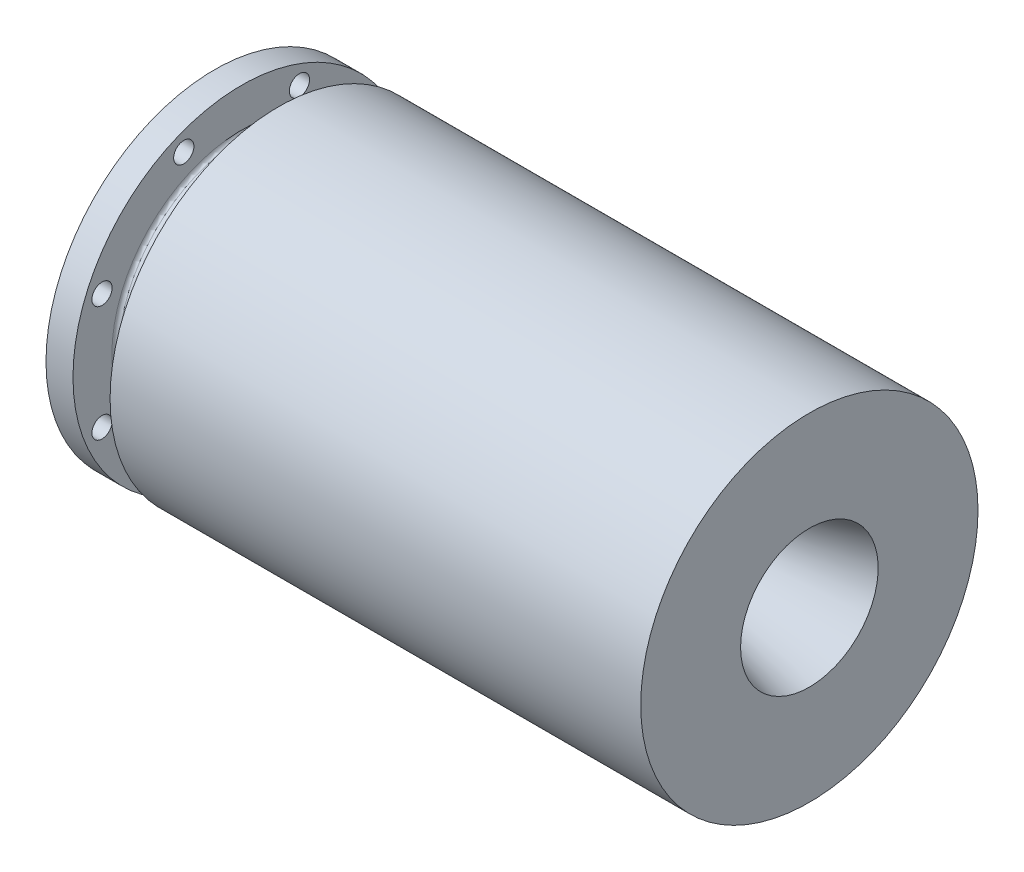
ISO-10303-21;
HEADER;
FILE_DESCRIPTION(('STEP AP214'),'2;1');
FILE_NAME('part.step','',(''),(''),'','','');
FILE_SCHEMA(('AUTOMOTIVE_DESIGN { 1 0 10303 214 1 1 1 1 }'));
ENDSEC;
DATA;
#1=APPLICATION_CONTEXT('core data for automotive mechanical design processes');
#2=APPLICATION_PROTOCOL_DEFINITION('international standard','automotive_design',2000,#1);
#3=PRODUCT_CONTEXT('',#1,'mechanical');
#4=PRODUCT('Part','Part','',(#3));
#5=PRODUCT_RELATED_PRODUCT_CATEGORY('part','',(#4));
#6=PRODUCT_DEFINITION_FORMATION('','',#4);
#7=PRODUCT_DEFINITION_CONTEXT('part definition',#1,'design');
#8=PRODUCT_DEFINITION('design','',#6,#7);
#9=PRODUCT_DEFINITION_SHAPE('','',#8);
#10=(LENGTH_UNIT() NAMED_UNIT(*) SI_UNIT(.MILLI.,.METRE.));
#11=(NAMED_UNIT(*) PLANE_ANGLE_UNIT() SI_UNIT($,.RADIAN.));
#12=(NAMED_UNIT(*) SI_UNIT($,.STERADIAN.) SOLID_ANGLE_UNIT());
#13=UNCERTAINTY_MEASURE_WITH_UNIT(LENGTH_MEASURE(1.E-05),#10,'distance_accuracy_value','');
#14=(GEOMETRIC_REPRESENTATION_CONTEXT(3) GLOBAL_UNCERTAINTY_ASSIGNED_CONTEXT((#13)) GLOBAL_UNIT_ASSIGNED_CONTEXT((#10,
#11,#12)) REPRESENTATION_CONTEXT('',''));
#15=CARTESIAN_POINT('',(0.,0.,0.));
#16=DIRECTION('',(0.,0.,1.));
#17=DIRECTION('',(1.,0.,0.));
#18=AXIS2_PLACEMENT_3D('',#15,#16,#17);
#19=CARTESIAN_POINT('',(0.,0.,0.));
#20=DIRECTION('',(-1.,0.,0.));
#21=DIRECTION('',(0.,0.,1.));
#22=AXIS2_PLACEMENT_3D('',#19,#20,#21);
#23=CYLINDRICAL_SURFACE('',#22,47.5996);
#24=CARTESIAN_POINT('',(22.86,0.,0.));
#25=DIRECTION('',(1.,0.,0.));
#26=DIRECTION('',(0.,0.,-1.));
#27=AXIS2_PLACEMENT_3D('',#24,#25,#26);
#28=CIRCLE('',#27,47.5996);
#29=CARTESIAN_POINT('',(22.86,0.,-47.5996));
#30=VERTEX_POINT('',#29);
#31=EDGE_CURVE('E62',#30,#30,#28,.F.);
#32=ORIENTED_EDGE('',*,*,#31,.T.);
#33=EDGE_LOOP('',(#32));
#34=FACE_BOUND('',#33,.T.);
#35=CARTESIAN_POINT('',(11.43,0.,0.));
#36=DIRECTION('',(-1.,0.,0.));
#37=DIRECTION('',(0.,0.,1.));
#38=AXIS2_PLACEMENT_3D('',#35,#36,#37);
#39=CIRCLE('',#38,47.5996);
#40=CARTESIAN_POINT('',(11.43,0.,47.5996));
#41=VERTEX_POINT('',#40);
#42=EDGE_CURVE('E65',#41,#41,#39,.F.);
#43=ORIENTED_EDGE('',*,*,#42,.T.);
#44=EDGE_LOOP('',(#43));
#45=FACE_BOUND('',#44,.T.);
#46=ADVANCED_FACE('F36',(#34,#45),#23,.T.);
#47=CARTESIAN_POINT('',(10.16,63.5,0.));
#48=DIRECTION('',(-1.,0.,0.));
#49=DIRECTION('',(0.,0.,1.));
#50=AXIS2_PLACEMENT_3D('',#47,#48,#49);
#51=PLANE('',#50);
#52=CARTESIAN_POINT('',(10.16,52.5650498817621,21.7731565678442));
#53=DIRECTION('',(-1.,0.,0.));
#54=DIRECTION('',(0.,0.,1.));
#55=AXIS2_PLACEMENT_3D('',#52,#53,#54);
#56=CIRCLE('',#55,3.81);
#57=CARTESIAN_POINT('',(10.16,52.5650498817621,25.5831565678442));
#58=VERTEX_POINT('',#57);
#59=EDGE_CURVE('E105',#58,#58,#56,.F.);
#60=ORIENTED_EDGE('',*,*,#59,.F.);
#61=EDGE_LOOP('',(#60));
#62=FACE_BOUND('',#61,.T.);
#63=CARTESIAN_POINT('',(10.16,21.773156567844,52.5650498817622));
#64=DIRECTION('',(-1.,0.,0.));
#65=DIRECTION('',(0.,0.,1.));
#66=AXIS2_PLACEMENT_3D('',#63,#64,#65);
#67=CIRCLE('',#66,3.81);
#68=CARTESIAN_POINT('',(10.16,21.773156567844,56.3750498817622));
#69=VERTEX_POINT('',#68);
#70=EDGE_CURVE('E141',#69,#69,#67,.F.);
#71=ORIENTED_EDGE('',*,*,#70,.F.);
#72=EDGE_LOOP('',(#71));
#73=FACE_BOUND('',#72,.T.);
#74=CARTESIAN_POINT('',(10.16,-21.7731565678444,52.5650498817621));
#75=DIRECTION('',(-1.,0.,0.));
#76=DIRECTION('',(0.,0.,1.));
#77=AXIS2_PLACEMENT_3D('',#74,#75,#76);
#78=CIRCLE('',#77,3.81);
#79=CARTESIAN_POINT('',(10.16,-21.7731565678444,56.3750498817621));
#80=VERTEX_POINT('',#79);
#81=EDGE_CURVE('E135',#80,#80,#78,.F.);
#82=ORIENTED_EDGE('',*,*,#81,.F.);
#83=EDGE_LOOP('',(#82));
#84=FACE_BOUND('',#83,.T.);
#85=CARTESIAN_POINT('',(10.16,-52.5650498817621,21.7731565678442));
#86=DIRECTION('',(-1.,0.,0.));
#87=DIRECTION('',(0.,0.,1.));
#88=AXIS2_PLACEMENT_3D('',#85,#86,#87);
#89=CIRCLE('',#88,3.81);
#90=CARTESIAN_POINT('',(10.16,-52.5650498817621,25.5831565678442));
#91=VERTEX_POINT('',#90);
#92=EDGE_CURVE('E129',#91,#91,#89,.F.);
#93=ORIENTED_EDGE('',*,*,#92,.F.);
#94=EDGE_LOOP('',(#93));
#95=FACE_BOUND('',#94,.T.);
#96=CARTESIAN_POINT('',(10.16,-52.565049881762,-21.7731565678446));
#97=DIRECTION('',(-1.,0.,0.));
#98=DIRECTION('',(0.,0.,1.));
#99=AXIS2_PLACEMENT_3D('',#96,#97,#98);
#100=CIRCLE('',#99,3.81);
#101=CARTESIAN_POINT('',(10.16,-52.565049881762,-17.9631565678446));
#102=VERTEX_POINT('',#101);
#103=EDGE_CURVE('E123',#102,#102,#100,.F.);
#104=ORIENTED_EDGE('',*,*,#103,.F.);
#105=EDGE_LOOP('',(#104));
#106=FACE_BOUND('',#105,.T.);
#107=CARTESIAN_POINT('',(10.16,-21.7731565678436,-52.5650498817624));
#108=DIRECTION('',(-1.,0.,0.));
#109=DIRECTION('',(0.,0.,1.));
#110=AXIS2_PLACEMENT_3D('',#107,#108,#109);
#111=CIRCLE('',#110,3.81);
#112=CARTESIAN_POINT('',(10.16,-21.7731565678436,-48.7550498817624));
#113=VERTEX_POINT('',#112);
#114=EDGE_CURVE('E117',#113,#113,#111,.F.);
#115=ORIENTED_EDGE('',*,*,#114,.F.);
#116=EDGE_LOOP('',(#115));
#117=FACE_BOUND('',#116,.T.);
#118=CARTESIAN_POINT('',(10.16,21.7731565678448,-52.5650498817619));
#119=DIRECTION('',(-1.,0.,0.));
#120=DIRECTION('',(0.,0.,1.));
#121=AXIS2_PLACEMENT_3D('',#118,#119,#120);
#122=CIRCLE('',#121,3.81);
#123=CARTESIAN_POINT('',(10.16,21.7731565678448,-48.7550498817619));
#124=VERTEX_POINT('',#123);
#125=EDGE_CURVE('E111',#124,#124,#122,.F.);
#126=ORIENTED_EDGE('',*,*,#125,.F.);
#127=EDGE_LOOP('',(#126));
#128=FACE_BOUND('',#127,.T.);
#129=CARTESIAN_POINT('',(10.16,52.5650498817621,-21.7731565678442));
#130=DIRECTION('',(-1.,0.,0.));
#131=DIRECTION('',(0.,0.,1.));
#132=AXIS2_PLACEMENT_3D('',#129,#130,#131);
#133=CIRCLE('',#132,3.81);
#134=CARTESIAN_POINT('',(10.16,52.5650498817621,-17.9631565678442));
#135=VERTEX_POINT('',#134);
#136=EDGE_CURVE('E101',#135,#135,#133,.F.);
#137=ORIENTED_EDGE('',*,*,#136,.F.);
#138=EDGE_LOOP('',(#137));
#139=FACE_BOUND('',#138,.T.);
#140=CARTESIAN_POINT('',(10.16,0.,0.));
#141=DIRECTION('',(-1.,0.,0.));
#142=DIRECTION('',(0.,0.,1.));
#143=AXIS2_PLACEMENT_3D('',#140,#141,#142);
#144=CIRCLE('',#143,48.8696);
#145=CARTESIAN_POINT('',(10.16,0.,48.8696));
#146=VERTEX_POINT('',#145);
#147=EDGE_CURVE('E56',#146,#146,#144,.T.);
#148=ORIENTED_EDGE('',*,*,#147,.T.);
#149=EDGE_LOOP('',(#148));
#150=FACE_BOUND('',#149,.T.);
#151=CARTESIAN_POINT('',(10.16,0.,0.));
#152=DIRECTION('',(-1.,0.,0.));
#153=DIRECTION('',(0.,0.,1.));
#154=AXIS2_PLACEMENT_3D('',#151,#152,#153);
#155=CIRCLE('',#154,63.5);
#156=CARTESIAN_POINT('',(10.16,0.,63.5));
#157=VERTEX_POINT('',#156);
#158=EDGE_CURVE('E68',#157,#157,#155,.T.);
#159=ORIENTED_EDGE('',*,*,#158,.F.);
#160=EDGE_LOOP('',(#159));
#161=FACE_BOUND('',#160,.T.);
#162=ADVANCED_FACE('F152',(#62,#73,#84,#95,#106,#117,#128,#139,#150,#161),#51,.F.);
#163=CARTESIAN_POINT('',(0.,0.,0.));
#164=DIRECTION('',(-1.,0.,0.));
#165=DIRECTION('',(0.,0.,1.));
#166=AXIS2_PLACEMENT_3D('',#163,#164,#165);
#167=CYLINDRICAL_SURFACE('',#166,63.5);
#168=CARTESIAN_POINT('',(0.,0.,0.));
#169=DIRECTION('',(-1.,0.,0.));
#170=DIRECTION('',(0.,0.,1.));
#171=AXIS2_PLACEMENT_3D('',#168,#169,#170);
#172=CIRCLE('',#171,63.5);
#173=CARTESIAN_POINT('',(0.,0.,63.5));
#174=VERTEX_POINT('',#173);
#175=EDGE_CURVE('E71',#174,#174,#172,.T.);
#176=ORIENTED_EDGE('',*,*,#175,.F.);
#177=EDGE_LOOP('',(#176));
#178=FACE_BOUND('',#177,.T.);
#179=ORIENTED_EDGE('',*,*,#158,.T.);
#180=EDGE_LOOP('',(#179));
#181=FACE_BOUND('',#180,.T.);
#182=ADVANCED_FACE('F155',(#178,#181),#167,.T.);
#183=CARTESIAN_POINT('',(0.,48.5902,0.));
#184=DIRECTION('',(1.,0.,0.));
#185=DIRECTION('',(0.,0.,-1.));
#186=AXIS2_PLACEMENT_3D('',#183,#184,#185);
#187=PLANE('',#186);
#188=CARTESIAN_POINT('',(0.,52.5650498817621,21.7731565678442));
#189=DIRECTION('',(-1.,0.,0.));
#190=DIRECTION('',(0.,-0.707106781186549,0.707106781186546));
#191=AXIS2_PLACEMENT_3D('',#188,#189,#190);
#192=CIRCLE('',#191,3.81);
#193=CARTESIAN_POINT('',(0.,49.8709730454414,24.4672334041649));
#194=VERTEX_POINT('',#193);
#195=EDGE_CURVE('E144',#194,#194,#192,.T.);
#196=ORIENTED_EDGE('',*,*,#195,.F.);
#197=EDGE_LOOP('',(#196));
#198=FACE_BOUND('',#197,.T.);
#199=CARTESIAN_POINT('',(0.,21.773156567844,52.5650498817622));
#200=DIRECTION('',(-1.,0.,0.));
#201=DIRECTION('',(0.,-1.,0.));
#202=AXIS2_PLACEMENT_3D('',#199,#200,#201);
#203=CIRCLE('',#202,3.81);
#204=CARTESIAN_POINT('',(0.,17.963156567844,52.5650498817622));
#205=VERTEX_POINT('',#204);
#206=EDGE_CURVE('E138',#205,#205,#203,.T.);
#207=ORIENTED_EDGE('',*,*,#206,.F.);
#208=EDGE_LOOP('',(#207));
#209=FACE_BOUND('',#208,.T.);
#210=CARTESIAN_POINT('',(0.,-21.7731565678444,52.5650498817621));
#211=DIRECTION('',(-1.,0.,0.));
#212=DIRECTION('',(0.,-0.707106781186544,-0.707106781186551));
#213=AXIS2_PLACEMENT_3D('',#210,#211,#212);
#214=CIRCLE('',#213,3.81);
#215=CARTESIAN_POINT('',(0.,-24.4672334041651,49.8709730454413));
#216=VERTEX_POINT('',#215);
#217=EDGE_CURVE('E132',#216,#216,#214,.T.);
#218=ORIENTED_EDGE('',*,*,#217,.F.);
#219=EDGE_LOOP('',(#218));
#220=FACE_BOUND('',#219,.T.);
#221=CARTESIAN_POINT('',(0.,-52.5650498817621,21.7731565678442));
#222=DIRECTION('',(-1.,0.,0.));
#223=DIRECTION('',(0.,0.,-1.));
#224=AXIS2_PLACEMENT_3D('',#221,#222,#223);
#225=CIRCLE('',#224,3.81);
#226=CARTESIAN_POINT('',(0.,-52.5650498817621,17.9631565678442));
#227=VERTEX_POINT('',#226);
#228=EDGE_CURVE('E126',#227,#227,#225,.T.);
#229=ORIENTED_EDGE('',*,*,#228,.F.);
#230=EDGE_LOOP('',(#229));
#231=FACE_BOUND('',#230,.T.);
#232=CARTESIAN_POINT('',(0.,-52.565049881762,-21.7731565678446));
#233=DIRECTION('',(-1.,0.,0.));
#234=DIRECTION('',(0.,0.707106781186554,-0.707106781186541));
#235=AXIS2_PLACEMENT_3D('',#232,#233,#234);
#236=CIRCLE('',#235,3.81);
#237=CARTESIAN_POINT('',(0.,-49.8709730454412,-24.4672334041653));
#238=VERTEX_POINT('',#237);
#239=EDGE_CURVE('E120',#238,#238,#236,.T.);
#240=ORIENTED_EDGE('',*,*,#239,.F.);
#241=EDGE_LOOP('',(#240));
#242=FACE_BOUND('',#241,.T.);
#243=CARTESIAN_POINT('',(0.,-21.7731565678436,-52.5650498817624));
#244=DIRECTION('',(-1.,0.,0.));
#245=DIRECTION('',(0.,1.,0.));
#246=AXIS2_PLACEMENT_3D('',#243,#244,#245);
#247=CIRCLE('',#246,3.81);
#248=CARTESIAN_POINT('',(0.,-17.9631565678436,-52.5650498817623));
#249=VERTEX_POINT('',#248);
#250=EDGE_CURVE('E114',#249,#249,#247,.T.);
#251=ORIENTED_EDGE('',*,*,#250,.F.);
#252=EDGE_LOOP('',(#251));
#253=FACE_BOUND('',#252,.T.);
#254=CARTESIAN_POINT('',(0.,21.7731565678448,-52.5650498817619));
#255=DIRECTION('',(-1.,0.,0.));
#256=DIRECTION('',(0.,0.707106781186539,0.707106781186556));
#257=AXIS2_PLACEMENT_3D('',#254,#255,#256);
#258=CIRCLE('',#257,3.81);
#259=CARTESIAN_POINT('',(0.,24.4672334041655,-49.8709730454411));
#260=VERTEX_POINT('',#259);
#261=EDGE_CURVE('E108',#260,#260,#258,.T.);
#262=ORIENTED_EDGE('',*,*,#261,.F.);
#263=EDGE_LOOP('',(#262));
#264=FACE_BOUND('',#263,.T.);
#265=CARTESIAN_POINT('',(0.,52.5650498817621,-21.7731565678442));
#266=DIRECTION('',(-1.,0.,0.));
#267=DIRECTION('',(0.,0.,1.));
#268=AXIS2_PLACEMENT_3D('',#265,#266,#267);
#269=CIRCLE('',#268,3.81);
#270=CARTESIAN_POINT('',(0.,52.5650498817621,-17.9631565678442));
#271=VERTEX_POINT('',#270);
#272=EDGE_CURVE('E102',#271,#271,#269,.T.);
#273=ORIENTED_EDGE('',*,*,#272,.F.);
#274=EDGE_LOOP('',(#273));
#275=FACE_BOUND('',#274,.T.);
#276=CARTESIAN_POINT('',(0.,0.,0.));
#277=DIRECTION('',(-1.,0.,0.));
#278=DIRECTION('',(0.,0.,1.));
#279=AXIS2_PLACEMENT_3D('',#276,#277,#278);
#280=CIRCLE('',#279,48.5902);
#281=CARTESIAN_POINT('',(0.,0.,48.5902));
#282=VERTEX_POINT('',#281);
#283=EDGE_CURVE('E74',#282,#282,#280,.T.);
#284=ORIENTED_EDGE('',*,*,#283,.F.);
#285=EDGE_LOOP('',(#284));
#286=FACE_BOUND('',#285,.T.);
#287=ORIENTED_EDGE('',*,*,#175,.T.);
#288=EDGE_LOOP('',(#287));
#289=FACE_BOUND('',#288,.T.);
#290=ADVANCED_FACE('F176',(#198,#209,#220,#231,#242,#253,#264,#275,#286,#289),#187,.F.);
#291=CARTESIAN_POINT('',(0.,0.,0.));
#292=DIRECTION('',(-1.,0.,0.));
#293=DIRECTION('',(0.,0.,1.));
#294=AXIS2_PLACEMENT_3D('',#291,#292,#293);
#295=CYLINDRICAL_SURFACE('',#294,48.5902);
#296=CARTESIAN_POINT('',(2.9718,0.,0.));
#297=DIRECTION('',(1.,0.,0.));
#298=DIRECTION('',(0.,0.,-1.));
#299=AXIS2_PLACEMENT_3D('',#296,#297,#298);
#300=CIRCLE('',#299,48.5902);
#301=CARTESIAN_POINT('',(2.9718,0.,-48.5902));
#302=VERTEX_POINT('',#301);
#303=EDGE_CURVE('E10',#302,#302,#300,.T.);
#304=ORIENTED_EDGE('',*,*,#303,.T.);
#305=EDGE_LOOP('',(#304));
#306=FACE_BOUND('',#305,.T.);
#307=ORIENTED_EDGE('',*,*,#283,.T.);
#308=EDGE_LOOP('',(#307));
#309=FACE_BOUND('',#308,.T.);
#310=ADVANCED_FACE('F182',(#306,#309),#295,.F.);
#311=CARTESIAN_POINT('',(3.8608,48.5902,0.));
#312=DIRECTION('',(1.,0.,0.));
#313=DIRECTION('',(0.,0.,-1.));
#314=AXIS2_PLACEMENT_3D('',#311,#312,#313);
#315=PLANE('',#314);
#316=CARTESIAN_POINT('',(3.8608,0.,0.));
#317=DIRECTION('',(1.,0.,0.));
#318=DIRECTION('',(0.,0.,-1.));
#319=AXIS2_PLACEMENT_3D('',#316,#317,#318);
#320=CIRCLE('',#319,43.4086);
#321=CARTESIAN_POINT('',(3.8608,0.,-43.4086));
#322=VERTEX_POINT('',#321);
#323=EDGE_CURVE('E43',#322,#322,#320,.T.);
#324=ORIENTED_EDGE('',*,*,#323,.T.);
#325=EDGE_LOOP('',(#324));
#326=FACE_BOUND('',#325,.T.);
#327=CARTESIAN_POINT('',(3.8608,0.,0.));
#328=DIRECTION('',(1.,0.,0.));
#329=DIRECTION('',(0.,0.,-1.));
#330=AXIS2_PLACEMENT_3D('',#327,#328,#329);
#331=CIRCLE('',#330,47.7012);
#332=CARTESIAN_POINT('',(3.8608,0.,-47.7012));
#333=VERTEX_POINT('',#332);
#334=EDGE_CURVE('E47',#333,#333,#331,.F.);
#335=ORIENTED_EDGE('',*,*,#334,.T.);
#336=EDGE_LOOP('',(#335));
#337=FACE_BOUND('',#336,.T.);
#338=ADVANCED_FACE('F220',(#326,#337),#315,.F.);
#339=CARTESIAN_POINT('',(0.,0.,0.));
#340=DIRECTION('',(-1.,0.,0.));
#341=DIRECTION('',(0.,0.,1.));
#342=AXIS2_PLACEMENT_3D('',#339,#340,#341);
#343=CYLINDRICAL_SURFACE('',#342,42.5196);
#344=CARTESIAN_POINT('',(2.9718,0.,0.));
#345=DIRECTION('',(1.,0.,0.));
#346=DIRECTION('',(0.,0.,-1.));
#347=AXIS2_PLACEMENT_3D('',#344,#345,#346);
#348=CIRCLE('',#347,42.5196);
#349=CARTESIAN_POINT('',(2.9718,0.,-42.5196));
#350=VERTEX_POINT('',#349);
#351=EDGE_CURVE('E51',#350,#350,#348,.F.);
#352=ORIENTED_EDGE('',*,*,#351,.T.);
#353=EDGE_LOOP('',(#352));
#354=FACE_BOUND('',#353,.T.);
#355=CARTESIAN_POINT('',(0.,0.,0.));
#356=DIRECTION('',(-1.,0.,0.));
#357=DIRECTION('',(0.,0.,1.));
#358=AXIS2_PLACEMENT_3D('',#355,#356,#357);
#359=CIRCLE('',#358,42.5196);
#360=CARTESIAN_POINT('',(0.,0.,42.5196));
#361=VERTEX_POINT('',#360);
#362=EDGE_CURVE('E77',#361,#361,#359,.T.);
#363=ORIENTED_EDGE('',*,*,#362,.F.);
#364=EDGE_LOOP('',(#363));
#365=FACE_BOUND('',#364,.T.);
#366=ADVANCED_FACE('F216',(#354,#365),#343,.T.);
#367=CARTESIAN_POINT('',(0.,33.8836,0.));
#368=DIRECTION('',(1.,0.,0.));
#369=DIRECTION('',(0.,0.,-1.));
#370=AXIS2_PLACEMENT_3D('',#367,#368,#369);
#371=PLANE('',#370);
#372=CARTESIAN_POINT('',(0.,0.,0.));
#373=DIRECTION('',(-1.,0.,0.));
#374=DIRECTION('',(0.,0.,1.));
#375=AXIS2_PLACEMENT_3D('',#372,#373,#374);
#376=CIRCLE('',#375,33.8836);
#377=CARTESIAN_POINT('',(0.,0.,33.8836));
#378=VERTEX_POINT('',#377);
#379=EDGE_CURVE('E80',#378,#378,#376,.T.);
#380=ORIENTED_EDGE('',*,*,#379,.F.);
#381=EDGE_LOOP('',(#380));
#382=FACE_BOUND('',#381,.T.);
#383=ORIENTED_EDGE('',*,*,#362,.T.);
#384=EDGE_LOOP('',(#383));
#385=FACE_BOUND('',#384,.T.);
#386=ADVANCED_FACE('F219',(#382,#385),#371,.F.);
#387=CARTESIAN_POINT('',(0.,0.,0.));
#388=DIRECTION('',(-1.,0.,0.));
#389=DIRECTION('',(0.,0.,1.));
#390=AXIS2_PLACEMENT_3D('',#387,#388,#389);
#391=CYLINDRICAL_SURFACE('',#390,33.8836);
#392=CARTESIAN_POINT('',(173.5582,0.,0.));
#393=DIRECTION('',(-1.,0.,0.));
#394=DIRECTION('',(0.,0.,1.));
#395=AXIS2_PLACEMENT_3D('',#392,#393,#394);
#396=CIRCLE('',#395,33.8836);
#397=CARTESIAN_POINT('',(173.5582,0.,33.8836));
#398=VERTEX_POINT('',#397);
#399=EDGE_CURVE('E83',#398,#398,#396,.T.);
#400=ORIENTED_EDGE('',*,*,#399,.F.);
#401=EDGE_LOOP('',(#400));
#402=FACE_BOUND('',#401,.T.);
#403=ORIENTED_EDGE('',*,*,#379,.T.);
#404=EDGE_LOOP('',(#403));
#405=FACE_BOUND('',#404,.T.);
#406=ADVANCED_FACE('F225',(#402,#405),#391,.F.);
#407=CARTESIAN_POINT('',(173.5582,0.,0.));
#408=DIRECTION('',(-1.,0.,0.));
#409=DIRECTION('',(0.,0.,1.));
#410=AXIS2_PLACEMENT_3D('',#407,#408,#409);
#411=CONICAL_SURFACE('',#410,33.8836,0.785398163397442);
#412=CARTESIAN_POINT('',(189.463049342222,0.,0.));
#413=DIRECTION('',(-1.,0.,0.));
#414=DIRECTION('',(0.,0.,1.));
#415=AXIS2_PLACEMENT_3D('',#412,#413,#414);
#416=CIRCLE('',#415,17.9787506577782);
#417=CARTESIAN_POINT('',(189.463049342222,0.,17.9787506577782));
#418=VERTEX_POINT('',#417);
#419=EDGE_CURVE('E86',#418,#418,#416,.T.);
#420=ORIENTED_EDGE('',*,*,#419,.F.);
#421=EDGE_LOOP('',(#420));
#422=FACE_BOUND('',#421,.T.);
#423=ORIENTED_EDGE('',*,*,#399,.T.);
#424=EDGE_LOOP('',(#423));
#425=FACE_BOUND('',#424,.T.);
#426=ADVANCED_FACE('F231',(#422,#425),#411,.F.);
#427=CARTESIAN_POINT('',(191.259100566436,0.,0.));
#428=DIRECTION('',(-1.,0.,0.));
#429=DIRECTION('',(0.,0.,1.));
#430=AXIS2_PLACEMENT_3D('',#427,#428,#429);
#431=TOROIDAL_SURFACE('',#430,19.774801881992,2.54);
#432=CARTESIAN_POINT('',(191.916500940996,0.,0.));
#433=DIRECTION('',(-1.,0.,0.));
#434=DIRECTION('',(0.,0.,1.));
#435=AXIS2_PLACEMENT_3D('',#432,#433,#434);
#436=CIRCLE('',#435,17.3213502832178);
#437=CARTESIAN_POINT('',(191.916500940996,0.,17.3213502832178));
#438=VERTEX_POINT('',#437);
#439=EDGE_CURVE('E89',#438,#438,#436,.T.);
#440=ORIENTED_EDGE('',*,*,#439,.F.);
#441=EDGE_LOOP('',(#440));
#442=FACE_BOUND('',#441,.T.);
#443=ORIENTED_EDGE('',*,*,#419,.T.);
#444=EDGE_LOOP('',(#443));
#445=FACE_BOUND('',#444,.T.);
#446=ADVANCED_FACE('F282',(#442,#445),#431,.T.);
#447=CARTESIAN_POINT('',(191.916500940996,0.,0.));
#448=DIRECTION('',(1.,0.,0.));
#449=DIRECTION('',(0.,0.,-1.));
#450=AXIS2_PLACEMENT_3D('',#447,#448,#449);
#451=CONICAL_SURFACE('',#450,17.3213502832178,0.26179938779915);
#452=CARTESIAN_POINT('',(223.962313950824,0.,0.));
#453=DIRECTION('',(-1.,0.,0.));
#454=DIRECTION('',(0.,0.,1.));
#455=AXIS2_PLACEMENT_3D('',#452,#453,#454);
#456=CIRCLE('',#455,25.908);
#457=CARTESIAN_POINT('',(223.962313950824,0.,25.908));
#458=VERTEX_POINT('',#457);
#459=EDGE_CURVE('E92',#458,#458,#456,.T.);
#460=ORIENTED_EDGE('',*,*,#459,.F.);
#461=EDGE_LOOP('',(#460));
#462=FACE_BOUND('',#461,.T.);
#463=ORIENTED_EDGE('',*,*,#439,.T.);
#464=EDGE_LOOP('',(#463));
#465=FACE_BOUND('',#464,.T.);
#466=ADVANCED_FACE('F292',(#462,#465),#451,.F.);
#467=CARTESIAN_POINT('',(223.962313950824,63.5,0.));
#468=DIRECTION('',(-1.,0.,0.));
#469=DIRECTION('',(0.,0.,1.));
#470=AXIS2_PLACEMENT_3D('',#467,#468,#469);
#471=PLANE('',#470);
#472=CARTESIAN_POINT('',(223.962313950824,0.,0.));
#473=DIRECTION('',(-1.,0.,0.));
#474=DIRECTION('',(0.,0.,1.));
#475=AXIS2_PLACEMENT_3D('',#472,#473,#474);
#476=CIRCLE('',#475,63.5);
#477=CARTESIAN_POINT('',(223.962313950824,0.,63.5));
#478=VERTEX_POINT('',#477);
#479=EDGE_CURVE('E95',#478,#478,#476,.T.);
#480=ORIENTED_EDGE('',*,*,#479,.F.);
#481=EDGE_LOOP('',(#480));
#482=FACE_BOUND('',#481,.T.);
#483=ORIENTED_EDGE('',*,*,#459,.T.);
#484=EDGE_LOOP('',(#483));
#485=FACE_BOUND('',#484,.T.);
#486=ADVANCED_FACE('F303',(#482,#485),#471,.F.);
#487=CARTESIAN_POINT('',(0.,0.,0.));
#488=DIRECTION('',(-1.,0.,0.));
#489=DIRECTION('',(0.,0.,1.));
#490=AXIS2_PLACEMENT_3D('',#487,#488,#489);
#491=CYLINDRICAL_SURFACE('',#490,63.5);
#492=CARTESIAN_POINT('',(24.13,0.,0.));
#493=DIRECTION('',(-1.,0.,0.));
#494=DIRECTION('',(0.,0.,1.));
#495=AXIS2_PLACEMENT_3D('',#492,#493,#494);
#496=CIRCLE('',#495,63.5);
#497=CARTESIAN_POINT('',(24.13,0.,63.5));
#498=VERTEX_POINT('',#497);
#499=EDGE_CURVE('E98',#498,#498,#496,.T.);
#500=ORIENTED_EDGE('',*,*,#499,.F.);
#501=EDGE_LOOP('',(#500));
#502=FACE_BOUND('',#501,.T.);
#503=ORIENTED_EDGE('',*,*,#479,.T.);
#504=EDGE_LOOP('',(#503));
#505=FACE_BOUND('',#504,.T.);
#506=ADVANCED_FACE('F314',(#502,#505),#491,.T.);
#507=CARTESIAN_POINT('',(24.13,47.5996,0.));
#508=DIRECTION('',(1.,0.,0.));
#509=DIRECTION('',(0.,0.,-1.));
#510=AXIS2_PLACEMENT_3D('',#507,#508,#509);
#511=PLANE('',#510);
#512=CARTESIAN_POINT('',(24.13,0.,0.));
#513=DIRECTION('',(1.,0.,0.));
#514=DIRECTION('',(0.,0.,-1.));
#515=AXIS2_PLACEMENT_3D('',#512,#513,#514);
#516=CIRCLE('',#515,48.8696);
#517=CARTESIAN_POINT('',(24.13,0.,-48.8696));
#518=VERTEX_POINT('',#517);
#519=EDGE_CURVE('E59',#518,#518,#516,.T.);
#520=ORIENTED_EDGE('',*,*,#519,.T.);
#521=EDGE_LOOP('',(#520));
#522=FACE_BOUND('',#521,.T.);
#523=ORIENTED_EDGE('',*,*,#499,.T.);
#524=EDGE_LOOP('',(#523));
#525=FACE_BOUND('',#524,.T.);
#526=ADVANCED_FACE('F197',(#522,#525),#511,.F.);
#527=CARTESIAN_POINT('',(22.86,0.,0.));
#528=DIRECTION('',(1.,0.,0.));
#529=DIRECTION('',(0.,0.,-1.));
#530=AXIS2_PLACEMENT_3D('',#527,#528,#529);
#531=TOROIDAL_SURFACE('',#530,48.8696,1.27);
#532=ORIENTED_EDGE('',*,*,#519,.F.);
#533=EDGE_LOOP('',(#532));
#534=FACE_BOUND('',#533,.T.);
#535=ORIENTED_EDGE('',*,*,#31,.F.);
#536=EDGE_LOOP('',(#535));
#537=FACE_BOUND('',#536,.T.);
#538=ADVANCED_FACE('F193',(#534,#537),#531,.F.);
#539=CARTESIAN_POINT('',(11.43,0.,0.));
#540=DIRECTION('',(-1.,0.,0.));
#541=DIRECTION('',(0.,0.,1.));
#542=AXIS2_PLACEMENT_3D('',#539,#540,#541);
#543=TOROIDAL_SURFACE('',#542,48.8696,1.27);
#544=ORIENTED_EDGE('',*,*,#42,.F.);
#545=EDGE_LOOP('',(#544));
#546=FACE_BOUND('',#545,.T.);
#547=ORIENTED_EDGE('',*,*,#147,.F.);
#548=EDGE_LOOP('',(#547));
#549=FACE_BOUND('',#548,.T.);
#550=ADVANCED_FACE('F196',(#546,#549),#543,.F.);
#551=CARTESIAN_POINT('',(223.963313950824,52.5650498817621,-21.7731565678442));
#552=DIRECTION('',(-1.,0.,0.));
#553=DIRECTION('',(0.,0.,1.));
#554=AXIS2_PLACEMENT_3D('',#551,#552,#553);
#555=CYLINDRICAL_SURFACE('',#554,3.81);
#556=ORIENTED_EDGE('',*,*,#272,.T.);
#557=EDGE_LOOP('',(#556));
#558=FACE_BOUND('',#557,.T.);
#559=ORIENTED_EDGE('',*,*,#136,.T.);
#560=EDGE_LOOP('',(#559));
#561=FACE_BOUND('',#560,.T.);
#562=ADVANCED_FACE('F200',(#558,#561),#555,.F.);
#563=CARTESIAN_POINT('',(223.963313950824,21.7731565678448,-52.5650498817619));
#564=DIRECTION('',(-1.,0.,0.));
#565=DIRECTION('',(0.,0.,1.));
#566=AXIS2_PLACEMENT_3D('',#563,#564,#565);
#567=CYLINDRICAL_SURFACE('',#566,3.81);
#568=ORIENTED_EDGE('',*,*,#261,.T.);
#569=EDGE_LOOP('',(#568));
#570=FACE_BOUND('',#569,.T.);
#571=ORIENTED_EDGE('',*,*,#125,.T.);
#572=EDGE_LOOP('',(#571));
#573=FACE_BOUND('',#572,.T.);
#574=ADVANCED_FACE('F361',(#570,#573),#567,.F.);
#575=CARTESIAN_POINT('',(223.963313950824,-21.7731565678436,-52.5650498817624));
#576=DIRECTION('',(-1.,0.,0.));
#577=DIRECTION('',(0.,0.,1.));
#578=AXIS2_PLACEMENT_3D('',#575,#576,#577);
#579=CYLINDRICAL_SURFACE('',#578,3.81);
#580=ORIENTED_EDGE('',*,*,#250,.T.);
#581=EDGE_LOOP('',(#580));
#582=FACE_BOUND('',#581,.T.);
#583=ORIENTED_EDGE('',*,*,#114,.T.);
#584=EDGE_LOOP('',(#583));
#585=FACE_BOUND('',#584,.T.);
#586=ADVANCED_FACE('F372',(#582,#585),#579,.F.);
#587=CARTESIAN_POINT('',(223.963313950824,-52.565049881762,-21.7731565678446));
#588=DIRECTION('',(-1.,0.,0.));
#589=DIRECTION('',(0.,0.,1.));
#590=AXIS2_PLACEMENT_3D('',#587,#588,#589);
#591=CYLINDRICAL_SURFACE('',#590,3.81);
#592=ORIENTED_EDGE('',*,*,#239,.T.);
#593=EDGE_LOOP('',(#592));
#594=FACE_BOUND('',#593,.T.);
#595=ORIENTED_EDGE('',*,*,#103,.T.);
#596=EDGE_LOOP('',(#595));
#597=FACE_BOUND('',#596,.T.);
#598=ADVANCED_FACE('F383',(#594,#597),#591,.F.);
#599=CARTESIAN_POINT('',(223.963313950824,-52.5650498817621,21.7731565678442));
#600=DIRECTION('',(-1.,0.,0.));
#601=DIRECTION('',(0.,0.,1.));
#602=AXIS2_PLACEMENT_3D('',#599,#600,#601);
#603=CYLINDRICAL_SURFACE('',#602,3.81);
#604=ORIENTED_EDGE('',*,*,#228,.T.);
#605=EDGE_LOOP('',(#604));
#606=FACE_BOUND('',#605,.T.);
#607=ORIENTED_EDGE('',*,*,#92,.T.);
#608=EDGE_LOOP('',(#607));
#609=FACE_BOUND('',#608,.T.);
#610=ADVANCED_FACE('F394',(#606,#609),#603,.F.);
#611=CARTESIAN_POINT('',(223.963313950824,-21.7731565678444,52.5650498817621));
#612=DIRECTION('',(-1.,0.,0.));
#613=DIRECTION('',(0.,0.,1.));
#614=AXIS2_PLACEMENT_3D('',#611,#612,#613);
#615=CYLINDRICAL_SURFACE('',#614,3.81);
#616=ORIENTED_EDGE('',*,*,#217,.T.);
#617=EDGE_LOOP('',(#616));
#618=FACE_BOUND('',#617,.T.);
#619=ORIENTED_EDGE('',*,*,#81,.T.);
#620=EDGE_LOOP('',(#619));
#621=FACE_BOUND('',#620,.T.);
#622=ADVANCED_FACE('F405',(#618,#621),#615,.F.);
#623=CARTESIAN_POINT('',(223.963313950824,21.773156567844,52.5650498817622));
#624=DIRECTION('',(-1.,0.,0.));
#625=DIRECTION('',(0.,0.,1.));
#626=AXIS2_PLACEMENT_3D('',#623,#624,#625);
#627=CYLINDRICAL_SURFACE('',#626,3.81);
#628=ORIENTED_EDGE('',*,*,#206,.T.);
#629=EDGE_LOOP('',(#628));
#630=FACE_BOUND('',#629,.T.);
#631=ORIENTED_EDGE('',*,*,#70,.T.);
#632=EDGE_LOOP('',(#631));
#633=FACE_BOUND('',#632,.T.);
#634=ADVANCED_FACE('F210',(#630,#633),#627,.F.);
#635=CARTESIAN_POINT('',(223.963313950824,52.5650498817621,21.7731565678442));
#636=DIRECTION('',(-1.,0.,0.));
#637=DIRECTION('',(0.,0.,1.));
#638=AXIS2_PLACEMENT_3D('',#635,#636,#637);
#639=CYLINDRICAL_SURFACE('',#638,3.81);
#640=ORIENTED_EDGE('',*,*,#195,.T.);
#641=EDGE_LOOP('',(#640));
#642=FACE_BOUND('',#641,.T.);
#643=ORIENTED_EDGE('',*,*,#59,.T.);
#644=EDGE_LOOP('',(#643));
#645=FACE_BOUND('',#644,.T.);
#646=ADVANCED_FACE('F150',(#642,#645),#639,.F.);
#647=CARTESIAN_POINT('',(2.9718,0.,0.));
#648=DIRECTION('',(1.,0.,0.));
#649=DIRECTION('',(0.,0.,-1.));
#650=AXIS2_PLACEMENT_3D('',#647,#648,#649);
#651=TOROIDAL_SURFACE('',#650,43.4086,0.889);
#652=ORIENTED_EDGE('',*,*,#323,.F.);
#653=EDGE_LOOP('',(#652));
#654=FACE_BOUND('',#653,.T.);
#655=ORIENTED_EDGE('',*,*,#351,.F.);
#656=EDGE_LOOP('',(#655));
#657=FACE_BOUND('',#656,.T.);
#658=ADVANCED_FACE('F202',(#654,#657),#651,.F.);
#659=CARTESIAN_POINT('',(2.9718,0.,0.));
#660=DIRECTION('',(1.,0.,0.));
#661=DIRECTION('',(0.,0.,-1.));
#662=AXIS2_PLACEMENT_3D('',#659,#660,#661);
#663=TOROIDAL_SURFACE('',#662,47.7012,0.889);
#664=ORIENTED_EDGE('',*,*,#303,.F.);
#665=EDGE_LOOP('',(#664));
#666=FACE_BOUND('',#665,.T.);
#667=ORIENTED_EDGE('',*,*,#334,.F.);
#668=EDGE_LOOP('',(#667));
#669=FACE_BOUND('',#668,.T.);
#670=ADVANCED_FACE('F38',(#666,#669),#663,.F.);
#671=CLOSED_SHELL('',(#46,#162,#182,#290,#310,#338,#366,#386,#406,#426,#446,#466,#486,#506,#526,
#538,#550,#562,#574,#586,#598,#610,#622,#634,#646,#658,#670));
#672=MANIFOLD_SOLID_BREP('B2',#671);
#673=ADVANCED_BREP_SHAPE_REPRESENTATION('',(#18,#672),#14);
#674=SHAPE_DEFINITION_REPRESENTATION(#9,#673);
ENDSEC;
END-ISO-10303-21;
